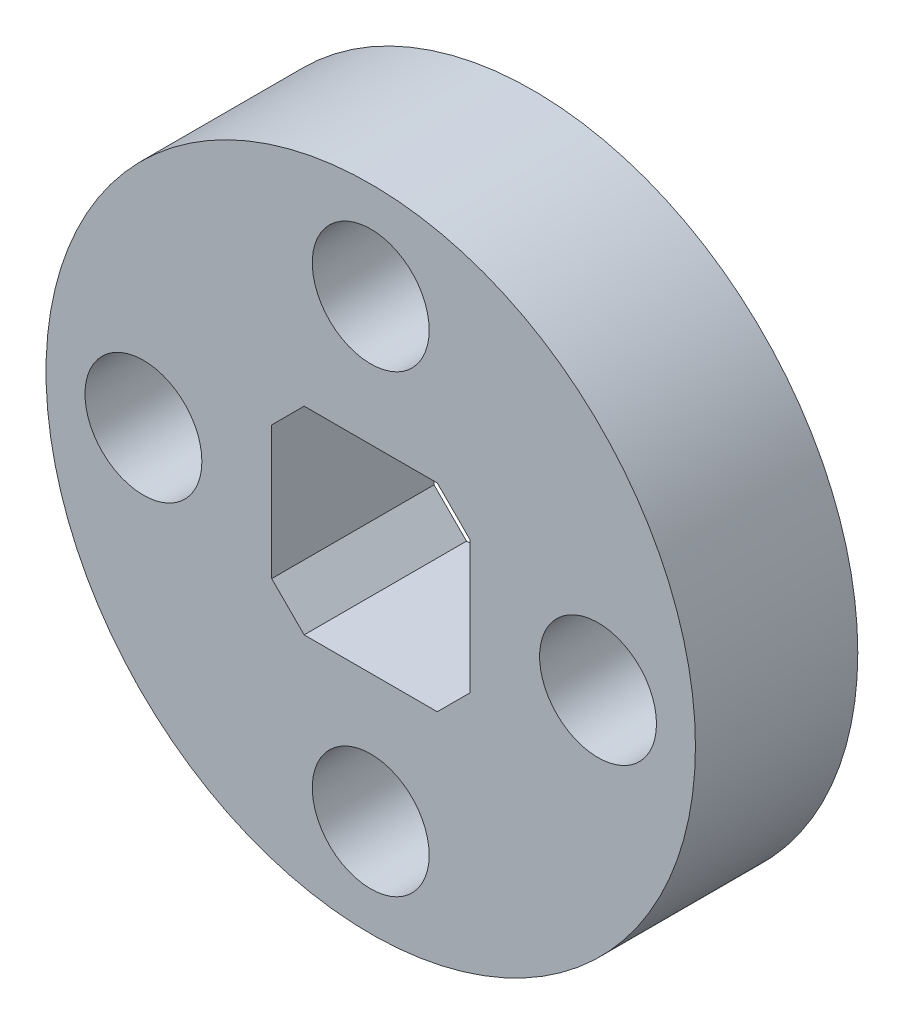
ISO-10303-21;
HEADER;
FILE_DESCRIPTION(('STEP AP214'),'2;1');
FILE_NAME('part.step','',(''),(''),'','','');
FILE_SCHEMA(('AUTOMOTIVE_DESIGN { 1 0 10303 214 1 1 1 1 }'));
ENDSEC;
DATA;
#1=APPLICATION_CONTEXT('core data for automotive mechanical design processes');
#2=APPLICATION_PROTOCOL_DEFINITION('international standard','automotive_design',2000,#1);
#3=PRODUCT_CONTEXT('',#1,'mechanical');
#4=PRODUCT('Part','Part','',(#3));
#5=PRODUCT_RELATED_PRODUCT_CATEGORY('part','',(#4));
#6=PRODUCT_DEFINITION_FORMATION('','',#4);
#7=PRODUCT_DEFINITION_CONTEXT('part definition',#1,'design');
#8=PRODUCT_DEFINITION('design','',#6,#7);
#9=PRODUCT_DEFINITION_SHAPE('','',#8);
#10=(LENGTH_UNIT() NAMED_UNIT(*) SI_UNIT(.MILLI.,.METRE.));
#11=(NAMED_UNIT(*) PLANE_ANGLE_UNIT() SI_UNIT($,.RADIAN.));
#12=(NAMED_UNIT(*) SI_UNIT($,.STERADIAN.) SOLID_ANGLE_UNIT());
#13=UNCERTAINTY_MEASURE_WITH_UNIT(LENGTH_MEASURE(1.E-05),#10,'distance_accuracy_value','');
#14=(GEOMETRIC_REPRESENTATION_CONTEXT(3) GLOBAL_UNCERTAINTY_ASSIGNED_CONTEXT((#13)) GLOBAL_UNIT_ASSIGNED_CONTEXT((#10,
#11,#12)) REPRESENTATION_CONTEXT('',''));
#15=CARTESIAN_POINT('',(0.,0.,0.));
#16=DIRECTION('',(0.,0.,1.));
#17=DIRECTION('',(1.,0.,0.));
#18=AXIS2_PLACEMENT_3D('',#15,#16,#17);
#19=CARTESIAN_POINT('',(0.,0.,5.));
#20=DIRECTION('',(0.,0.,1.));
#21=DIRECTION('',(1.,0.,0.));
#22=AXIS2_PLACEMENT_3D('',#19,#20,#21);
#23=PLANE('',#22);
#24=CARTESIAN_POINT('',(7.,0.,5.));
#25=DIRECTION('',(0.,0.,1.));
#26=DIRECTION('',(1.,0.,0.));
#27=AXIS2_PLACEMENT_3D('',#24,#25,#26);
#28=CIRCLE('',#27,1.8);
#29=CARTESIAN_POINT('',(8.8,0.,5.));
#30=VERTEX_POINT('',#29);
#31=EDGE_CURVE('E184',#30,#30,#28,.T.);
#32=ORIENTED_EDGE('',*,*,#31,.F.);
#33=EDGE_LOOP('',(#32));
#34=FACE_BOUND('',#33,.T.);
#35=CARTESIAN_POINT('',(0.,-7.,5.));
#36=DIRECTION('',(0.,0.,1.));
#37=DIRECTION('',(1.,0.,0.));
#38=AXIS2_PLACEMENT_3D('',#35,#36,#37);
#39=CIRCLE('',#38,1.8);
#40=CARTESIAN_POINT('',(1.8,-7.,5.));
#41=VERTEX_POINT('',#40);
#42=EDGE_CURVE('E351',#41,#41,#39,.T.);
#43=ORIENTED_EDGE('',*,*,#42,.F.);
#44=EDGE_LOOP('',(#43));
#45=FACE_BOUND('',#44,.T.);
#46=CARTESIAN_POINT('',(-7.,0.,5.));
#47=DIRECTION('',(0.,0.,1.));
#48=DIRECTION('',(1.,0.,0.));
#49=AXIS2_PLACEMENT_3D('',#46,#47,#48);
#50=CIRCLE('',#49,1.8);
#51=CARTESIAN_POINT('',(-5.2,0.,5.));
#52=VERTEX_POINT('',#51);
#53=EDGE_CURVE('E338',#52,#52,#50,.T.);
#54=ORIENTED_EDGE('',*,*,#53,.F.);
#55=EDGE_LOOP('',(#54));
#56=FACE_BOUND('',#55,.T.);
#57=CARTESIAN_POINT('',(0.,7.,5.));
#58=DIRECTION('',(0.,0.,1.));
#59=DIRECTION('',(1.,0.,0.));
#60=AXIS2_PLACEMENT_3D('',#57,#58,#59);
#61=CIRCLE('',#60,1.8);
#62=CARTESIAN_POINT('',(1.8,7.,5.));
#63=VERTEX_POINT('',#62);
#64=EDGE_CURVE('E176',#63,#63,#61,.T.);
#65=ORIENTED_EDGE('',*,*,#64,.F.);
#66=EDGE_LOOP('',(#65));
#67=FACE_BOUND('',#66,.T.);
#68=CARTESIAN_POINT('',(0.,0.,5.));
#69=DIRECTION('',(0.,0.,1.));
#70=DIRECTION('',(1.,0.,0.));
#71=AXIS2_PLACEMENT_3D('',#68,#69,#70);
#72=CIRCLE('',#71,10.);
#73=CARTESIAN_POINT('',(10.,0.,5.));
#74=VERTEX_POINT('',#73);
#75=EDGE_CURVE('E125',#74,#74,#72,.T.);
#76=ORIENTED_EDGE('',*,*,#75,.T.);
#77=EDGE_LOOP('',(#76));
#78=FACE_BOUND('',#77,.T.);
#79=DIRECTION('',(-1.,0.,0.));
#80=VECTOR('',#79,1.);
#81=CARTESIAN_POINT('',(-3.05,3.05,5.));
#82=LINE('',#81,#80);
#83=CARTESIAN_POINT('',(2.05,3.05,5.));
#84=VERTEX_POINT('',#83);
#85=CARTESIAN_POINT('',(-2.04999999999999,3.05,5.));
#86=VERTEX_POINT('',#85);
#87=EDGE_CURVE('E170',#84,#86,#82,.T.);
#88=ORIENTED_EDGE('',*,*,#87,.F.);
#89=DIRECTION('',(-0.707106781186544,0.707106781186551,0.));
#90=VECTOR('',#89,1.);
#91=CARTESIAN_POINT('',(3.05,2.04999999999999,5.));
#92=LINE('',#91,#90);
#93=CARTESIAN_POINT('',(3.05,2.04999999999999,5.));
#94=VERTEX_POINT('',#93);
#95=EDGE_CURVE('E110',#84,#94,#92,.F.);
#96=ORIENTED_EDGE('',*,*,#95,.T.);
#97=DIRECTION('',(0.,1.,0.));
#98=VECTOR('',#97,1.);
#99=CARTESIAN_POINT('',(3.05,3.05,5.));
#100=LINE('',#99,#98);
#101=CARTESIAN_POINT('',(3.05,-2.05,5.));
#102=VERTEX_POINT('',#101);
#103=EDGE_CURVE('E159',#102,#94,#100,.T.);
#104=ORIENTED_EDGE('',*,*,#103,.F.);
#105=DIRECTION('',(0.707106781186551,0.707106781186544,0.));
#106=VECTOR('',#105,1.);
#107=CARTESIAN_POINT('',(2.04999999999999,-3.05,5.));
#108=LINE('',#107,#106);
#109=CARTESIAN_POINT('',(2.04999999999999,-3.05,5.));
#110=VERTEX_POINT('',#109);
#111=EDGE_CURVE('E48',#102,#110,#108,.F.);
#112=ORIENTED_EDGE('',*,*,#111,.T.);
#113=DIRECTION('',(1.,0.,0.));
#114=VECTOR('',#113,1.);
#115=CARTESIAN_POINT('',(-3.05,-3.05,5.));
#116=LINE('',#115,#114);
#117=CARTESIAN_POINT('',(-2.05,-3.05,5.));
#118=VERTEX_POINT('',#117);
#119=EDGE_CURVE('E166',#118,#110,#116,.T.);
#120=ORIENTED_EDGE('',*,*,#119,.F.);
#121=DIRECTION('',(0.707106781186544,-0.707106781186551,0.));
#122=VECTOR('',#121,1.);
#123=CARTESIAN_POINT('',(-3.05,-2.04999999999999,5.));
#124=LINE('',#123,#122);
#125=CARTESIAN_POINT('',(-3.05,-2.04999999999999,5.));
#126=VERTEX_POINT('',#125);
#127=EDGE_CURVE('E11',#118,#126,#124,.F.);
#128=ORIENTED_EDGE('',*,*,#127,.T.);
#129=DIRECTION('',(0.,-1.,0.));
#130=VECTOR('',#129,1.);
#131=CARTESIAN_POINT('',(-3.05,3.05,5.));
#132=LINE('',#131,#130);
#133=CARTESIAN_POINT('',(-3.05,2.05,5.));
#134=VERTEX_POINT('',#133);
#135=EDGE_CURVE('E164',#134,#126,#132,.T.);
#136=ORIENTED_EDGE('',*,*,#135,.F.);
#137=DIRECTION('',(-0.707106781186551,-0.707106781186544,0.));
#138=VECTOR('',#137,1.);
#139=CARTESIAN_POINT('',(-2.04999999999999,3.05,5.));
#140=LINE('',#139,#138);
#141=EDGE_CURVE('E111',#134,#86,#140,.F.);
#142=ORIENTED_EDGE('',*,*,#141,.T.);
#143=EDGE_LOOP('',(#88,#96,#104,#112,#120,#128,#136,#142));
#144=FACE_BOUND('',#143,.T.);
#145=ADVANCED_FACE('F33',(#34,#45,#56,#67,#78,#144),#23,.T.);
#146=CARTESIAN_POINT('',(0.,0.,0.));
#147=DIRECTION('',(0.,0.,1.));
#148=DIRECTION('',(1.,0.,0.));
#149=AXIS2_PLACEMENT_3D('',#146,#147,#148);
#150=PLANE('',#149);
#151=CARTESIAN_POINT('',(7.,0.,0.));
#152=DIRECTION('',(0.,0.,1.));
#153=DIRECTION('',(1.,0.,0.));
#154=AXIS2_PLACEMENT_3D('',#151,#152,#153);
#155=CIRCLE('',#154,1.8);
#156=CARTESIAN_POINT('',(8.8,0.,0.));
#157=VERTEX_POINT('',#156);
#158=EDGE_CURVE('E346',#157,#157,#155,.T.);
#159=ORIENTED_EDGE('',*,*,#158,.T.);
#160=EDGE_LOOP('',(#159));
#161=FACE_BOUND('',#160,.T.);
#162=CARTESIAN_POINT('',(0.,-7.,0.));
#163=DIRECTION('',(0.,0.,1.));
#164=DIRECTION('',(1.,0.,0.));
#165=AXIS2_PLACEMENT_3D('',#162,#163,#164);
#166=CIRCLE('',#165,1.8);
#167=CARTESIAN_POINT('',(1.8,-7.,0.));
#168=VERTEX_POINT('',#167);
#169=EDGE_CURVE('E343',#168,#168,#166,.T.);
#170=ORIENTED_EDGE('',*,*,#169,.T.);
#171=EDGE_LOOP('',(#170));
#172=FACE_BOUND('',#171,.T.);
#173=CARTESIAN_POINT('',(-7.,0.,0.));
#174=DIRECTION('',(0.,0.,1.));
#175=DIRECTION('',(1.,0.,0.));
#176=AXIS2_PLACEMENT_3D('',#173,#174,#175);
#177=CIRCLE('',#176,1.8);
#178=CARTESIAN_POINT('',(-5.2,0.,0.));
#179=VERTEX_POINT('',#178);
#180=EDGE_CURVE('E341',#179,#179,#177,.T.);
#181=ORIENTED_EDGE('',*,*,#180,.T.);
#182=EDGE_LOOP('',(#181));
#183=FACE_BOUND('',#182,.T.);
#184=CARTESIAN_POINT('',(0.,7.,0.));
#185=DIRECTION('',(0.,0.,1.));
#186=DIRECTION('',(1.,0.,0.));
#187=AXIS2_PLACEMENT_3D('',#184,#185,#186);
#188=CIRCLE('',#187,1.8);
#189=CARTESIAN_POINT('',(1.8,7.,0.));
#190=VERTEX_POINT('',#189);
#191=EDGE_CURVE('E179',#190,#190,#188,.T.);
#192=ORIENTED_EDGE('',*,*,#191,.T.);
#193=EDGE_LOOP('',(#192));
#194=FACE_BOUND('',#193,.T.);
#195=CARTESIAN_POINT('',(0.,0.,0.));
#196=DIRECTION('',(0.,0.,1.));
#197=DIRECTION('',(1.,0.,0.));
#198=AXIS2_PLACEMENT_3D('',#195,#196,#197);
#199=CIRCLE('',#198,10.);
#200=CARTESIAN_POINT('',(10.,0.,0.));
#201=VERTEX_POINT('',#200);
#202=EDGE_CURVE('E130',#201,#201,#199,.T.);
#203=ORIENTED_EDGE('',*,*,#202,.F.);
#204=EDGE_LOOP('',(#203));
#205=FACE_BOUND('',#204,.T.);
#206=DIRECTION('',(1.,0.,0.));
#207=VECTOR('',#206,1.);
#208=CARTESIAN_POINT('',(-3.05,-3.05,0.));
#209=LINE('',#208,#207);
#210=CARTESIAN_POINT('',(-2.05,-3.05,0.));
#211=VERTEX_POINT('',#210);
#212=CARTESIAN_POINT('',(2.04999999999999,-3.05,0.));
#213=VERTEX_POINT('',#212);
#214=EDGE_CURVE('E153',#211,#213,#209,.T.);
#215=ORIENTED_EDGE('',*,*,#214,.T.);
#216=DIRECTION('',(-0.707106781186551,-0.707106781186544,0.));
#217=VECTOR('',#216,1.);
#218=CARTESIAN_POINT('',(2.54999999999999,-2.55000000000001,0.));
#219=LINE('',#218,#217);
#220=CARTESIAN_POINT('',(3.05,-2.05,0.));
#221=VERTEX_POINT('',#220);
#222=EDGE_CURVE('E150',#213,#221,#219,.F.);
#223=ORIENTED_EDGE('',*,*,#222,.T.);
#224=DIRECTION('',(0.,1.,0.));
#225=VECTOR('',#224,1.);
#226=CARTESIAN_POINT('',(3.05,3.05,0.));
#227=LINE('',#226,#225);
#228=CARTESIAN_POINT('',(3.05,2.04999999999999,0.));
#229=VERTEX_POINT('',#228);
#230=EDGE_CURVE('E105',#221,#229,#227,.T.);
#231=ORIENTED_EDGE('',*,*,#230,.T.);
#232=DIRECTION('',(0.707106781186544,-0.707106781186551,0.));
#233=VECTOR('',#232,1.);
#234=CARTESIAN_POINT('',(2.55000000000001,2.54999999999999,0.));
#235=LINE('',#234,#233);
#236=CARTESIAN_POINT('',(2.05,3.05,0.));
#237=VERTEX_POINT('',#236);
#238=EDGE_CURVE('E99',#229,#237,#235,.F.);
#239=ORIENTED_EDGE('',*,*,#238,.T.);
#240=DIRECTION('',(-1.,0.,0.));
#241=VECTOR('',#240,1.);
#242=CARTESIAN_POINT('',(-3.05,3.05,0.));
#243=LINE('',#242,#241);
#244=CARTESIAN_POINT('',(-2.04999999999999,3.05,0.));
#245=VERTEX_POINT('',#244);
#246=EDGE_CURVE('E103',#237,#245,#243,.T.);
#247=ORIENTED_EDGE('',*,*,#246,.T.);
#248=DIRECTION('',(0.707106781186551,0.707106781186544,0.));
#249=VECTOR('',#248,1.);
#250=CARTESIAN_POINT('',(-2.54999999999999,2.55000000000001,0.));
#251=LINE('',#250,#249);
#252=CARTESIAN_POINT('',(-3.05,2.05,0.));
#253=VERTEX_POINT('',#252);
#254=EDGE_CURVE('E146',#245,#253,#251,.F.);
#255=ORIENTED_EDGE('',*,*,#254,.T.);
#256=DIRECTION('',(0.,-1.,0.));
#257=VECTOR('',#256,1.);
#258=CARTESIAN_POINT('',(-3.05,3.05,0.));
#259=LINE('',#258,#257);
#260=CARTESIAN_POINT('',(-3.05,-2.04999999999999,0.));
#261=VERTEX_POINT('',#260);
#262=EDGE_CURVE('E121',#253,#261,#259,.T.);
#263=ORIENTED_EDGE('',*,*,#262,.T.);
#264=DIRECTION('',(-0.707106781186544,0.707106781186551,0.));
#265=VECTOR('',#264,1.);
#266=CARTESIAN_POINT('',(-2.55000000000001,-2.54999999999999,0.));
#267=LINE('',#266,#265);
#268=EDGE_CURVE('E41',#261,#211,#267,.F.);
#269=ORIENTED_EDGE('',*,*,#268,.T.);
#270=EDGE_LOOP('',(#215,#223,#231,#239,#247,#255,#263,#269));
#271=FACE_BOUND('',#270,.T.);
#272=ADVANCED_FACE('F102',(#161,#172,#183,#194,#205,#271),#150,.F.);
#273=CARTESIAN_POINT('',(0.,0.,5.));
#274=DIRECTION('',(0.,0.,-1.));
#275=DIRECTION('',(-1.,0.,0.));
#276=AXIS2_PLACEMENT_3D('',#273,#274,#275);
#277=CYLINDRICAL_SURFACE('',#276,10.);
#278=ORIENTED_EDGE('',*,*,#75,.F.);
#279=EDGE_LOOP('',(#278));
#280=FACE_BOUND('',#279,.T.);
#281=ORIENTED_EDGE('',*,*,#202,.T.);
#282=EDGE_LOOP('',(#281));
#283=FACE_BOUND('',#282,.T.);
#284=ADVANCED_FACE('F206',(#280,#283),#277,.T.);
#285=CARTESIAN_POINT('',(3.05,3.05,5.));
#286=DIRECTION('',(-1.,0.,0.));
#287=DIRECTION('',(0.,0.,1.));
#288=AXIS2_PLACEMENT_3D('',#285,#286,#287);
#289=PLANE('',#288);
#290=ORIENTED_EDGE('',*,*,#103,.T.);
#291=DIRECTION('',(0.,0.,-1.));
#292=VECTOR('',#291,1.);
#293=CARTESIAN_POINT('',(3.05,2.04999999999999,0.));
#294=LINE('',#293,#292);
#295=EDGE_CURVE('E140',#94,#229,#294,.T.);
#296=ORIENTED_EDGE('',*,*,#295,.T.);
#297=ORIENTED_EDGE('',*,*,#230,.F.);
#298=DIRECTION('',(0.,0.,1.));
#299=VECTOR('',#298,1.);
#300=CARTESIAN_POINT('',(3.05,-2.05,5.));
#301=LINE('',#300,#299);
#302=EDGE_CURVE('E138',#221,#102,#301,.T.);
#303=ORIENTED_EDGE('',*,*,#302,.T.);
#304=EDGE_LOOP('',(#290,#296,#297,#303));
#305=FACE_BOUND('',#304,.T.);
#306=ADVANCED_FACE('F189',(#305),#289,.T.);
#307=CARTESIAN_POINT('',(-3.05,3.05,5.));
#308=DIRECTION('',(0.,-1.,0.));
#309=DIRECTION('',(0.,0.,-1.));
#310=AXIS2_PLACEMENT_3D('',#307,#308,#309);
#311=PLANE('',#310);
#312=ORIENTED_EDGE('',*,*,#87,.T.);
#313=DIRECTION('',(0.,0.,-1.));
#314=VECTOR('',#313,1.);
#315=CARTESIAN_POINT('',(-2.04999999999999,3.05,0.));
#316=LINE('',#315,#314);
#317=EDGE_CURVE('E120',#86,#245,#316,.T.);
#318=ORIENTED_EDGE('',*,*,#317,.T.);
#319=ORIENTED_EDGE('',*,*,#246,.F.);
#320=DIRECTION('',(0.,0.,1.));
#321=VECTOR('',#320,1.);
#322=CARTESIAN_POINT('',(2.05,3.05,5.));
#323=LINE('',#322,#321);
#324=EDGE_CURVE('E117',#237,#84,#323,.T.);
#325=ORIENTED_EDGE('',*,*,#324,.T.);
#326=EDGE_LOOP('',(#312,#318,#319,#325));
#327=FACE_BOUND('',#326,.T.);
#328=ADVANCED_FACE('F116',(#327),#311,.T.);
#329=CARTESIAN_POINT('',(-3.05,3.05,5.));
#330=DIRECTION('',(1.,0.,0.));
#331=DIRECTION('',(0.,0.,-1.));
#332=AXIS2_PLACEMENT_3D('',#329,#330,#331);
#333=PLANE('',#332);
#334=ORIENTED_EDGE('',*,*,#262,.F.);
#335=DIRECTION('',(0.,0.,1.));
#336=VECTOR('',#335,1.);
#337=CARTESIAN_POINT('',(-3.05,2.05,5.));
#338=LINE('',#337,#336);
#339=EDGE_CURVE('E136',#253,#134,#338,.T.);
#340=ORIENTED_EDGE('',*,*,#339,.T.);
#341=ORIENTED_EDGE('',*,*,#135,.T.);
#342=DIRECTION('',(0.,0.,-1.));
#343=VECTOR('',#342,1.);
#344=CARTESIAN_POINT('',(-3.05,-2.04999999999999,0.));
#345=LINE('',#344,#343);
#346=EDGE_CURVE('E127',#126,#261,#345,.T.);
#347=ORIENTED_EDGE('',*,*,#346,.T.);
#348=EDGE_LOOP('',(#334,#340,#341,#347));
#349=FACE_BOUND('',#348,.T.);
#350=ADVANCED_FACE('F168',(#349),#333,.T.);
#351=CARTESIAN_POINT('',(-3.05,-3.05,5.));
#352=DIRECTION('',(0.,1.,0.));
#353=DIRECTION('',(0.,0.,1.));
#354=AXIS2_PLACEMENT_3D('',#351,#352,#353);
#355=PLANE('',#354);
#356=ORIENTED_EDGE('',*,*,#119,.T.);
#357=DIRECTION('',(0.,0.,-1.));
#358=VECTOR('',#357,1.);
#359=CARTESIAN_POINT('',(2.04999999999999,-3.05,0.));
#360=LINE('',#359,#358);
#361=EDGE_CURVE('E143',#110,#213,#360,.T.);
#362=ORIENTED_EDGE('',*,*,#361,.T.);
#363=ORIENTED_EDGE('',*,*,#214,.F.);
#364=DIRECTION('',(0.,0.,1.));
#365=VECTOR('',#364,1.);
#366=CARTESIAN_POINT('',(-2.05,-3.05,5.));
#367=LINE('',#366,#365);
#368=EDGE_CURVE('E55',#211,#118,#367,.T.);
#369=ORIENTED_EDGE('',*,*,#368,.T.);
#370=EDGE_LOOP('',(#356,#362,#363,#369));
#371=FACE_BOUND('',#370,.T.);
#372=ADVANCED_FACE('F157',(#371),#355,.T.);
#373=CARTESIAN_POINT('',(0.,7.,0.));
#374=DIRECTION('',(0.,0.,1.));
#375=DIRECTION('',(1.,0.,0.));
#376=AXIS2_PLACEMENT_3D('',#373,#374,#375);
#377=CYLINDRICAL_SURFACE('',#376,1.8);
#378=ORIENTED_EDGE('',*,*,#64,.T.);
#379=EDGE_LOOP('',(#378));
#380=FACE_BOUND('',#379,.T.);
#381=ORIENTED_EDGE('',*,*,#191,.F.);
#382=EDGE_LOOP('',(#381));
#383=FACE_BOUND('',#382,.T.);
#384=ADVANCED_FACE('F237',(#380,#383),#377,.F.);
#385=CARTESIAN_POINT('',(-7.,0.,0.));
#386=DIRECTION('',(0.,0.,1.));
#387=DIRECTION('',(1.,0.,0.));
#388=AXIS2_PLACEMENT_3D('',#385,#386,#387);
#389=CYLINDRICAL_SURFACE('',#388,1.8);
#390=ORIENTED_EDGE('',*,*,#53,.T.);
#391=EDGE_LOOP('',(#390));
#392=FACE_BOUND('',#391,.T.);
#393=ORIENTED_EDGE('',*,*,#180,.F.);
#394=EDGE_LOOP('',(#393));
#395=FACE_BOUND('',#394,.T.);
#396=ADVANCED_FACE('F229',(#392,#395),#389,.F.);
#397=CARTESIAN_POINT('',(0.,-7.,0.));
#398=DIRECTION('',(0.,0.,1.));
#399=DIRECTION('',(1.,0.,0.));
#400=AXIS2_PLACEMENT_3D('',#397,#398,#399);
#401=CYLINDRICAL_SURFACE('',#400,1.8);
#402=ORIENTED_EDGE('',*,*,#42,.T.);
#403=EDGE_LOOP('',(#402));
#404=FACE_BOUND('',#403,.T.);
#405=ORIENTED_EDGE('',*,*,#169,.F.);
#406=EDGE_LOOP('',(#405));
#407=FACE_BOUND('',#406,.T.);
#408=ADVANCED_FACE('F223',(#404,#407),#401,.F.);
#409=CARTESIAN_POINT('',(7.,0.,0.));
#410=DIRECTION('',(0.,0.,1.));
#411=DIRECTION('',(1.,0.,0.));
#412=AXIS2_PLACEMENT_3D('',#409,#410,#411);
#413=CYLINDRICAL_SURFACE('',#412,1.8);
#414=ORIENTED_EDGE('',*,*,#31,.T.);
#415=EDGE_LOOP('',(#414));
#416=FACE_BOUND('',#415,.T.);
#417=ORIENTED_EDGE('',*,*,#158,.F.);
#418=EDGE_LOOP('',(#417));
#419=FACE_BOUND('',#418,.T.);
#420=ADVANCED_FACE('F218',(#416,#419),#413,.F.);
#421=CARTESIAN_POINT('',(-2.04999999999999,3.05,5.));
#422=DIRECTION('',(0.707106781186544,-0.707106781186551,0.));
#423=DIRECTION('',(0.,0.,1.));
#424=AXIS2_PLACEMENT_3D('',#421,#422,#423);
#425=PLANE('',#424);
#426=ORIENTED_EDGE('',*,*,#141,.F.);
#427=ORIENTED_EDGE('',*,*,#339,.F.);
#428=ORIENTED_EDGE('',*,*,#254,.F.);
#429=ORIENTED_EDGE('',*,*,#317,.F.);
#430=EDGE_LOOP('',(#426,#427,#428,#429));
#431=FACE_BOUND('',#430,.T.);
#432=ADVANCED_FACE('F198',(#431),#425,.T.);
#433=CARTESIAN_POINT('',(3.05,2.04999999999999,5.));
#434=DIRECTION('',(-0.707106781186551,-0.707106781186544,0.));
#435=DIRECTION('',(0.,0.,1.));
#436=AXIS2_PLACEMENT_3D('',#433,#434,#435);
#437=PLANE('',#436);
#438=ORIENTED_EDGE('',*,*,#95,.F.);
#439=ORIENTED_EDGE('',*,*,#324,.F.);
#440=ORIENTED_EDGE('',*,*,#238,.F.);
#441=ORIENTED_EDGE('',*,*,#295,.F.);
#442=EDGE_LOOP('',(#438,#439,#440,#441));
#443=FACE_BOUND('',#442,.T.);
#444=ADVANCED_FACE('F124',(#443),#437,.T.);
#445=CARTESIAN_POINT('',(2.04999999999999,-3.05,5.));
#446=DIRECTION('',(-0.707106781186544,0.707106781186551,0.));
#447=DIRECTION('',(0.,0.,1.));
#448=AXIS2_PLACEMENT_3D('',#445,#446,#447);
#449=PLANE('',#448);
#450=ORIENTED_EDGE('',*,*,#111,.F.);
#451=ORIENTED_EDGE('',*,*,#302,.F.);
#452=ORIENTED_EDGE('',*,*,#222,.F.);
#453=ORIENTED_EDGE('',*,*,#361,.F.);
#454=EDGE_LOOP('',(#450,#451,#452,#453));
#455=FACE_BOUND('',#454,.T.);
#456=ADVANCED_FACE('F192',(#455),#449,.T.);
#457=CARTESIAN_POINT('',(-3.05,-2.04999999999999,5.));
#458=DIRECTION('',(0.707106781186551,0.707106781186544,0.));
#459=DIRECTION('',(0.,0.,1.));
#460=AXIS2_PLACEMENT_3D('',#457,#458,#459);
#461=PLANE('',#460);
#462=ORIENTED_EDGE('',*,*,#127,.F.);
#463=ORIENTED_EDGE('',*,*,#368,.F.);
#464=ORIENTED_EDGE('',*,*,#268,.F.);
#465=ORIENTED_EDGE('',*,*,#346,.F.);
#466=EDGE_LOOP('',(#462,#463,#464,#465));
#467=FACE_BOUND('',#466,.T.);
#468=ADVANCED_FACE('F35',(#467),#461,.T.);
#469=CLOSED_SHELL('',(#145,#272,#284,#306,#328,#350,#372,#384,#396,#408,#420,#432,#444,#456,#468));
#470=MANIFOLD_SOLID_BREP('B2',#469);
#471=ADVANCED_BREP_SHAPE_REPRESENTATION('',(#18,#470),#14);
#472=SHAPE_DEFINITION_REPRESENTATION(#9,#471);
ENDSEC;
END-ISO-10303-21;
